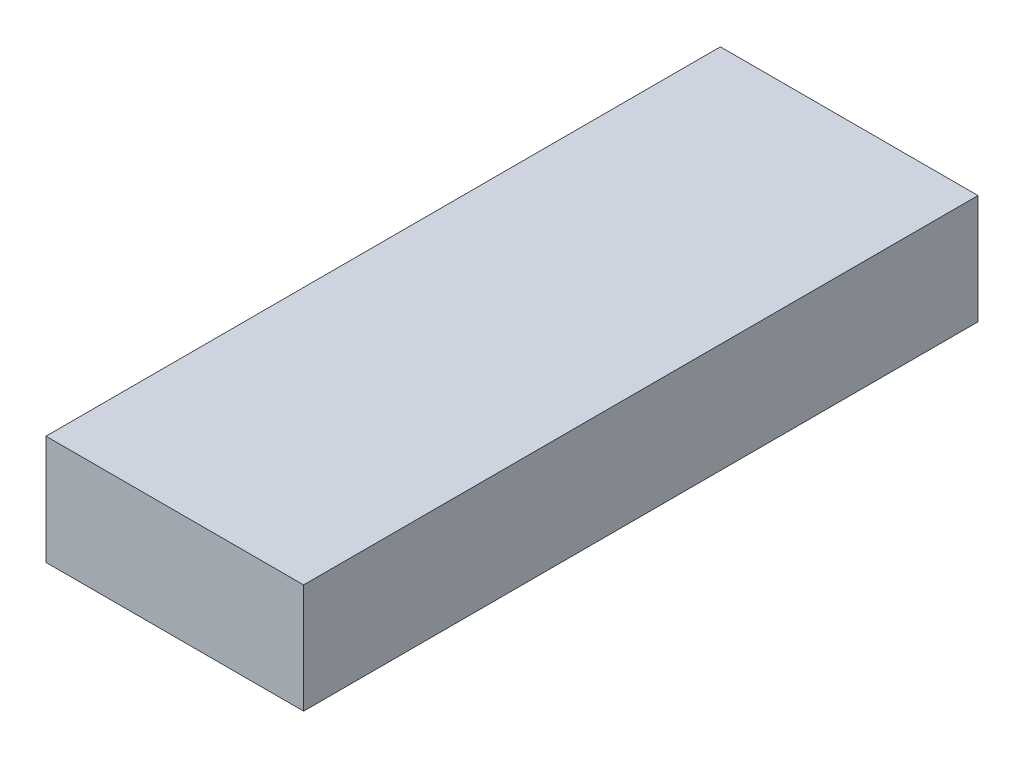
ISO-10303-21;
HEADER;
FILE_DESCRIPTION(('STEP AP214'),'2;1');
FILE_NAME('part.step','',(''),(''),'','','');
FILE_SCHEMA(('AUTOMOTIVE_DESIGN { 1 0 10303 214 1 1 1 1 }'));
ENDSEC;
DATA;
#1=APPLICATION_CONTEXT('core data for automotive mechanical design processes');
#2=APPLICATION_PROTOCOL_DEFINITION('international standard','automotive_design',2000,#1);
#3=PRODUCT_CONTEXT('',#1,'mechanical');
#4=PRODUCT('Part','Part','',(#3));
#5=PRODUCT_RELATED_PRODUCT_CATEGORY('part','',(#4));
#6=PRODUCT_DEFINITION_FORMATION('','',#4);
#7=PRODUCT_DEFINITION_CONTEXT('part definition',#1,'design');
#8=PRODUCT_DEFINITION('design','',#6,#7);
#9=PRODUCT_DEFINITION_SHAPE('','',#8);
#10=(LENGTH_UNIT() NAMED_UNIT(*) SI_UNIT(.MILLI.,.METRE.));
#11=(NAMED_UNIT(*) PLANE_ANGLE_UNIT() SI_UNIT($,.RADIAN.));
#12=(NAMED_UNIT(*) SI_UNIT($,.STERADIAN.) SOLID_ANGLE_UNIT());
#13=UNCERTAINTY_MEASURE_WITH_UNIT(LENGTH_MEASURE(1.E-05),#10,'distance_accuracy_value','');
#14=(GEOMETRIC_REPRESENTATION_CONTEXT(3) GLOBAL_UNCERTAINTY_ASSIGNED_CONTEXT((#13)) GLOBAL_UNIT_ASSIGNED_CONTEXT((#10,
#11,#12)) REPRESENTATION_CONTEXT('',''));
#15=CARTESIAN_POINT('',(0.,0.,0.));
#16=DIRECTION('',(0.,0.,1.));
#17=DIRECTION('',(1.,0.,0.));
#18=AXIS2_PLACEMENT_3D('',#15,#16,#17);
#19=CARTESIAN_POINT('',(13.462,5.715,35.2425));
#20=DIRECTION('',(-1.,0.,0.));
#21=DIRECTION('',(0.,0.,1.));
#22=AXIS2_PLACEMENT_3D('',#19,#20,#21);
#23=PLANE('',#22);
#24=DIRECTION('',(0.,0.,-1.));
#25=VECTOR('',#24,1.);
#26=CARTESIAN_POINT('',(13.462,-5.715,35.2425));
#27=LINE('',#26,#25);
#28=CARTESIAN_POINT('',(13.462,-5.715,35.2425));
#29=VERTEX_POINT('',#28);
#30=CARTESIAN_POINT('',(13.462,-5.715,-35.2425));
#31=VERTEX_POINT('',#30);
#32=EDGE_CURVE('E98',#29,#31,#27,.T.);
#33=ORIENTED_EDGE('',*,*,#32,.T.);
#34=DIRECTION('',(0.,-1.,0.));
#35=VECTOR('',#34,1.);
#36=CARTESIAN_POINT('',(13.462,5.715,-35.2425));
#37=LINE('',#36,#35);
#38=CARTESIAN_POINT('',(13.462,5.715,-35.2425));
#39=VERTEX_POINT('',#38);
#40=EDGE_CURVE('E11',#39,#31,#37,.T.);
#41=ORIENTED_EDGE('',*,*,#40,.F.);
#42=DIRECTION('',(0.,0.,-1.));
#43=VECTOR('',#42,1.);
#44=CARTESIAN_POINT('',(13.462,5.715,35.2425));
#45=LINE('',#44,#43);
#46=CARTESIAN_POINT('',(13.462,5.715,35.2425));
#47=VERTEX_POINT('',#46);
#48=EDGE_CURVE('E86',#47,#39,#45,.T.);
#49=ORIENTED_EDGE('',*,*,#48,.F.);
#50=DIRECTION('',(0.,-1.,0.));
#51=VECTOR('',#50,1.);
#52=CARTESIAN_POINT('',(13.462,5.715,35.2425));
#53=LINE('',#52,#51);
#54=EDGE_CURVE('E94',#47,#29,#53,.T.);
#55=ORIENTED_EDGE('',*,*,#54,.T.);
#56=EDGE_LOOP('',(#33,#41,#49,#55));
#57=FACE_BOUND('',#56,.T.);
#58=ADVANCED_FACE('F35',(#57),#23,.F.);
#59=CARTESIAN_POINT('',(-13.462,5.715,-35.2425));
#60=DIRECTION('',(0.,0.,1.));
#61=DIRECTION('',(1.,0.,0.));
#62=AXIS2_PLACEMENT_3D('',#59,#60,#61);
#63=PLANE('',#62);
#64=DIRECTION('',(-1.,0.,0.));
#65=VECTOR('',#64,1.);
#66=CARTESIAN_POINT('',(-13.462,-5.715,-35.2425));
#67=LINE('',#66,#65);
#68=CARTESIAN_POINT('',(-13.462,-5.715,-35.2425));
#69=VERTEX_POINT('',#68);
#70=EDGE_CURVE('E90',#31,#69,#67,.T.);
#71=ORIENTED_EDGE('',*,*,#70,.T.);
#72=DIRECTION('',(0.,-1.,0.));
#73=VECTOR('',#72,1.);
#74=CARTESIAN_POINT('',(-13.462,5.715,-35.2425));
#75=LINE('',#74,#73);
#76=CARTESIAN_POINT('',(-13.462,5.715,-35.2425));
#77=VERTEX_POINT('',#76);
#78=EDGE_CURVE('E43',#77,#69,#75,.T.);
#79=ORIENTED_EDGE('',*,*,#78,.F.);
#80=DIRECTION('',(-1.,0.,0.));
#81=VECTOR('',#80,1.);
#82=CARTESIAN_POINT('',(-13.462,5.715,-35.2425));
#83=LINE('',#82,#81);
#84=EDGE_CURVE('E81',#39,#77,#83,.T.);
#85=ORIENTED_EDGE('',*,*,#84,.F.);
#86=ORIENTED_EDGE('',*,*,#40,.T.);
#87=EDGE_LOOP('',(#71,#79,#85,#86));
#88=FACE_BOUND('',#87,.T.);
#89=ADVANCED_FACE('F89',(#88),#63,.F.);
#90=CARTESIAN_POINT('',(-13.462,5.715,35.2425));
#91=DIRECTION('',(1.,0.,0.));
#92=DIRECTION('',(0.,0.,-1.));
#93=AXIS2_PLACEMENT_3D('',#90,#91,#92);
#94=PLANE('',#93);
#95=DIRECTION('',(0.,0.,1.));
#96=VECTOR('',#95,1.);
#97=CARTESIAN_POINT('',(-13.462,-5.715,35.2425));
#98=LINE('',#97,#96);
#99=CARTESIAN_POINT('',(-13.462,-5.715,35.2425));
#100=VERTEX_POINT('',#99);
#101=EDGE_CURVE('E68',#69,#100,#98,.T.);
#102=ORIENTED_EDGE('',*,*,#101,.T.);
#103=DIRECTION('',(0.,-1.,0.));
#104=VECTOR('',#103,1.);
#105=CARTESIAN_POINT('',(-13.462,5.715,35.2425));
#106=LINE('',#105,#104);
#107=CARTESIAN_POINT('',(-13.462,5.715,35.2425));
#108=VERTEX_POINT('',#107);
#109=EDGE_CURVE('E91',#108,#100,#106,.T.);
#110=ORIENTED_EDGE('',*,*,#109,.F.);
#111=DIRECTION('',(0.,0.,1.));
#112=VECTOR('',#111,1.);
#113=CARTESIAN_POINT('',(-13.462,5.715,35.2425));
#114=LINE('',#113,#112);
#115=EDGE_CURVE('E84',#77,#108,#114,.T.);
#116=ORIENTED_EDGE('',*,*,#115,.F.);
#117=ORIENTED_EDGE('',*,*,#78,.T.);
#118=EDGE_LOOP('',(#102,#110,#116,#117));
#119=FACE_BOUND('',#118,.T.);
#120=ADVANCED_FACE('F92',(#119),#94,.F.);
#121=CARTESIAN_POINT('',(-13.462,5.715,35.2425));
#122=DIRECTION('',(0.,0.,-1.));
#123=DIRECTION('',(-1.,0.,0.));
#124=AXIS2_PLACEMENT_3D('',#121,#122,#123);
#125=PLANE('',#124);
#126=DIRECTION('',(1.,0.,0.));
#127=VECTOR('',#126,1.);
#128=CARTESIAN_POINT('',(-13.462,-5.715,35.2425));
#129=LINE('',#128,#127);
#130=EDGE_CURVE('E74',#100,#29,#129,.T.);
#131=ORIENTED_EDGE('',*,*,#130,.T.);
#132=ORIENTED_EDGE('',*,*,#54,.F.);
#133=DIRECTION('',(1.,0.,0.));
#134=VECTOR('',#133,1.);
#135=CARTESIAN_POINT('',(-13.462,5.715,35.2425));
#136=LINE('',#135,#134);
#137=EDGE_CURVE('E51',#108,#47,#136,.T.);
#138=ORIENTED_EDGE('',*,*,#137,.F.);
#139=ORIENTED_EDGE('',*,*,#109,.T.);
#140=EDGE_LOOP('',(#131,#132,#138,#139));
#141=FACE_BOUND('',#140,.T.);
#142=ADVANCED_FACE('F105',(#141),#125,.F.);
#143=CARTESIAN_POINT('',(0.,5.715,0.));
#144=DIRECTION('',(0.,-1.,0.));
#145=DIRECTION('',(0.,0.,-1.));
#146=AXIS2_PLACEMENT_3D('',#143,#144,#145);
#147=PLANE('',#146);
#148=ORIENTED_EDGE('',*,*,#48,.T.);
#149=ORIENTED_EDGE('',*,*,#84,.T.);
#150=ORIENTED_EDGE('',*,*,#115,.T.);
#151=ORIENTED_EDGE('',*,*,#137,.T.);
#152=EDGE_LOOP('',(#148,#149,#150,#151));
#153=FACE_BOUND('',#152,.T.);
#154=ADVANCED_FACE('F82',(#153),#147,.F.);
#155=CARTESIAN_POINT('',(0.,-5.715,0.));
#156=DIRECTION('',(0.,-1.,0.));
#157=DIRECTION('',(0.,0.,-1.));
#158=AXIS2_PLACEMENT_3D('',#155,#156,#157);
#159=PLANE('',#158);
#160=ORIENTED_EDGE('',*,*,#32,.F.);
#161=ORIENTED_EDGE('',*,*,#130,.F.);
#162=ORIENTED_EDGE('',*,*,#101,.F.);
#163=ORIENTED_EDGE('',*,*,#70,.F.);
#164=EDGE_LOOP('',(#160,#161,#162,#163));
#165=FACE_BOUND('',#164,.T.);
#166=ADVANCED_FACE('F108',(#165),#159,.T.);
#167=CLOSED_SHELL('',(#58,#89,#120,#142,#154,#166));
#168=MANIFOLD_SOLID_BREP('B2',#167);
#169=ADVANCED_BREP_SHAPE_REPRESENTATION('',(#18,#168),#14);
#170=SHAPE_DEFINITION_REPRESENTATION(#9,#169);
ENDSEC;
END-ISO-10303-21;
